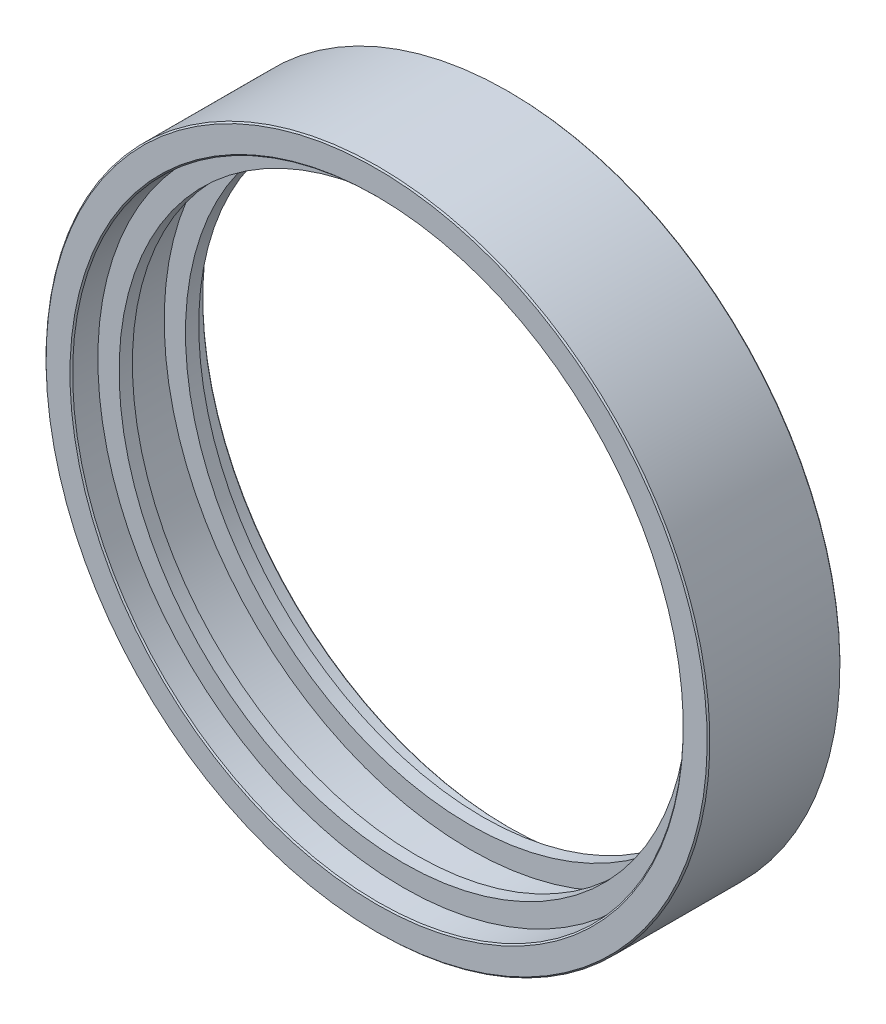
ISO-10303-21;
HEADER;
FILE_DESCRIPTION(('STEP AP214'),'2;1');
FILE_NAME('part.step','',(''),(''),'','','');
FILE_SCHEMA(('AUTOMOTIVE_DESIGN { 1 0 10303 214 1 1 1 1 }'));
ENDSEC;
DATA;
#1=APPLICATION_CONTEXT('core data for automotive mechanical design processes');
#2=APPLICATION_PROTOCOL_DEFINITION('international standard','automotive_design',2000,#1);
#3=PRODUCT_CONTEXT('',#1,'mechanical');
#4=PRODUCT('Part','Part','',(#3));
#5=PRODUCT_RELATED_PRODUCT_CATEGORY('part','',(#4));
#6=PRODUCT_DEFINITION_FORMATION('','',#4);
#7=PRODUCT_DEFINITION_CONTEXT('part definition',#1,'design');
#8=PRODUCT_DEFINITION('design','',#6,#7);
#9=PRODUCT_DEFINITION_SHAPE('','',#8);
#10=(LENGTH_UNIT() NAMED_UNIT(*) SI_UNIT(.MILLI.,.METRE.));
#11=(NAMED_UNIT(*) PLANE_ANGLE_UNIT() SI_UNIT($,.RADIAN.));
#12=(NAMED_UNIT(*) SI_UNIT($,.STERADIAN.) SOLID_ANGLE_UNIT());
#13=UNCERTAINTY_MEASURE_WITH_UNIT(LENGTH_MEASURE(1.E-05),#10,'distance_accuracy_value','');
#14=(GEOMETRIC_REPRESENTATION_CONTEXT(3) GLOBAL_UNCERTAINTY_ASSIGNED_CONTEXT((#13)) GLOBAL_UNIT_ASSIGNED_CONTEXT((#10,
#11,#12)) REPRESENTATION_CONTEXT('',''));
#15=CARTESIAN_POINT('',(0.,0.,0.));
#16=DIRECTION('',(0.,0.,1.));
#17=DIRECTION('',(1.,0.,0.));
#18=AXIS2_PLACEMENT_3D('',#15,#16,#17);
#19=CARTESIAN_POINT('',(0.,11.5,-0.56338028169014));
#20=DIRECTION('',(0.,0.,1.));
#21=DIRECTION('',(0.,-1.,0.));
#22=AXIS2_PLACEMENT_3D('',#19,#20,#21);
#23=PLANE('',#22);
#24=CARTESIAN_POINT('',(0.,0.,-0.563380281690142));
#25=DIRECTION('',(0.,0.,1.));
#26=DIRECTION('',(0.,-1.,0.));
#27=AXIS2_PLACEMENT_3D('',#24,#25,#26);
#28=CIRCLE('',#27,12.45);
#29=CARTESIAN_POINT('',(0.,-12.45,-0.563380281690145));
#30=VERTEX_POINT('',#29);
#31=EDGE_CURVE('E40',#30,#30,#28,.T.);
#32=ORIENTED_EDGE('',*,*,#31,.T.);
#33=EDGE_LOOP('',(#32));
#34=FACE_BOUND('',#33,.T.);
#35=CARTESIAN_POINT('',(0.,0.,-0.563380281690142));
#36=DIRECTION('',(0.,0.,1.));
#37=DIRECTION('',(0.,-1.,0.));
#38=AXIS2_PLACEMENT_3D('',#35,#36,#37);
#39=CIRCLE('',#38,11.55);
#40=CARTESIAN_POINT('',(0.,-11.55,-0.563380281690145));
#41=VERTEX_POINT('',#40);
#42=EDGE_CURVE('E44',#41,#41,#39,.F.);
#43=ORIENTED_EDGE('',*,*,#42,.T.);
#44=EDGE_LOOP('',(#43));
#45=FACE_BOUND('',#44,.T.);
#46=ADVANCED_FACE('F33',(#34,#45),#23,.T.);
#47=CARTESIAN_POINT('',(0.,0.,0.));
#48=DIRECTION('',(0.,0.,-1.));
#49=DIRECTION('',(0.,1.,0.));
#50=AXIS2_PLACEMENT_3D('',#47,#48,#49);
#51=CYLINDRICAL_SURFACE('',#50,12.5);
#52=CARTESIAN_POINT('',(0.,0.,-5.51338028169015));
#53=DIRECTION('',(0.,0.,-1.));
#54=DIRECTION('',(0.,1.,0.));
#55=AXIS2_PLACEMENT_3D('',#52,#53,#54);
#56=CIRCLE('',#55,12.5);
#57=CARTESIAN_POINT('',(0.,12.5,-5.51338028169015));
#58=VERTEX_POINT('',#57);
#59=EDGE_CURVE('E48',#58,#58,#56,.F.);
#60=ORIENTED_EDGE('',*,*,#59,.T.);
#61=EDGE_LOOP('',(#60));
#62=FACE_BOUND('',#61,.T.);
#63=CARTESIAN_POINT('',(0.,0.,-0.613380281690149));
#64=DIRECTION('',(0.,0.,1.));
#65=DIRECTION('',(0.,-1.,0.));
#66=AXIS2_PLACEMENT_3D('',#63,#64,#65);
#67=CIRCLE('',#66,12.5);
#68=CARTESIAN_POINT('',(0.,-12.5,-0.613380281690152));
#69=VERTEX_POINT('',#68);
#70=EDGE_CURVE('E53',#69,#69,#67,.F.);
#71=ORIENTED_EDGE('',*,*,#70,.T.);
#72=EDGE_LOOP('',(#71));
#73=FACE_BOUND('',#72,.T.);
#74=ADVANCED_FACE('F107',(#62,#73),#51,.T.);
#75=CARTESIAN_POINT('',(0.,12.5,-5.56338028169014));
#76=DIRECTION('',(0.,0.,-1.));
#77=DIRECTION('',(0.,1.,0.));
#78=AXIS2_PLACEMENT_3D('',#75,#76,#77);
#79=PLANE('',#78);
#80=CARTESIAN_POINT('',(0.,0.,-5.56338028169014));
#81=DIRECTION('',(0.,0.,-1.));
#82=DIRECTION('',(0.,1.,0.));
#83=AXIS2_PLACEMENT_3D('',#80,#81,#82);
#84=CIRCLE('',#83,11.55);
#85=CARTESIAN_POINT('',(0.,11.55,-5.56338028169014));
#86=VERTEX_POINT('',#85);
#87=EDGE_CURVE('E56',#86,#86,#84,.F.);
#88=ORIENTED_EDGE('',*,*,#87,.T.);
#89=EDGE_LOOP('',(#88));
#90=FACE_BOUND('',#89,.T.);
#91=CARTESIAN_POINT('',(0.,0.,-5.56338028169014));
#92=DIRECTION('',(0.,0.,-1.));
#93=DIRECTION('',(0.,1.,0.));
#94=AXIS2_PLACEMENT_3D('',#91,#92,#93);
#95=CIRCLE('',#94,12.45);
#96=CARTESIAN_POINT('',(0.,12.45,-5.56338028169014));
#97=VERTEX_POINT('',#96);
#98=EDGE_CURVE('E59',#97,#97,#95,.T.);
#99=ORIENTED_EDGE('',*,*,#98,.T.);
#100=EDGE_LOOP('',(#99));
#101=FACE_BOUND('',#100,.T.);
#102=ADVANCED_FACE('F112',(#90,#101),#79,.T.);
#103=CARTESIAN_POINT('',(0.,0.,0.));
#104=DIRECTION('',(0.,0.,-1.));
#105=DIRECTION('',(0.,1.,0.));
#106=AXIS2_PLACEMENT_3D('',#103,#104,#105);
#107=CYLINDRICAL_SURFACE('',#106,11.5);
#108=CARTESIAN_POINT('',(0.,0.,-5.51338028169014));
#109=DIRECTION('',(0.,0.,-1.));
#110=DIRECTION('',(0.,1.,0.));
#111=AXIS2_PLACEMENT_3D('',#108,#109,#110);
#112=CIRCLE('',#111,11.5);
#113=CARTESIAN_POINT('',(0.,11.5,-5.51338028169014));
#114=VERTEX_POINT('',#113);
#115=EDGE_CURVE('E62',#114,#114,#112,.T.);
#116=ORIENTED_EDGE('',*,*,#115,.T.);
#117=EDGE_LOOP('',(#116));
#118=FACE_BOUND('',#117,.T.);
#119=CARTESIAN_POINT('',(0.,0.,-4.56338028169014));
#120=DIRECTION('',(0.,0.,-1.));
#121=DIRECTION('',(0.,1.,0.));
#122=AXIS2_PLACEMENT_3D('',#119,#120,#121);
#123=CIRCLE('',#122,11.5);
#124=CARTESIAN_POINT('',(0.,11.5,-4.56338028169014));
#125=VERTEX_POINT('',#124);
#126=EDGE_CURVE('E65',#125,#125,#123,.T.);
#127=ORIENTED_EDGE('',*,*,#126,.F.);
#128=EDGE_LOOP('',(#127));
#129=FACE_BOUND('',#128,.T.);
#130=ADVANCED_FACE('F166',(#118,#129),#107,.F.);
#131=CARTESIAN_POINT('',(0.,11.5,-4.56338028169014));
#132=DIRECTION('',(0.,0.,-1.));
#133=DIRECTION('',(0.,1.,0.));
#134=AXIS2_PLACEMENT_3D('',#131,#132,#133);
#135=PLANE('',#134);
#136=ORIENTED_EDGE('',*,*,#126,.T.);
#137=EDGE_LOOP('',(#136));
#138=FACE_BOUND('',#137,.T.);
#139=CARTESIAN_POINT('',(0.,0.,-4.56338028169014));
#140=DIRECTION('',(0.,0.,-1.));
#141=DIRECTION('',(0.,1.,0.));
#142=AXIS2_PLACEMENT_3D('',#139,#140,#141);
#143=CIRCLE('',#142,10.7);
#144=CARTESIAN_POINT('',(0.,10.7,-4.56338028169014));
#145=VERTEX_POINT('',#144);
#146=EDGE_CURVE('E68',#145,#145,#143,.T.);
#147=ORIENTED_EDGE('',*,*,#146,.F.);
#148=EDGE_LOOP('',(#147));
#149=FACE_BOUND('',#148,.T.);
#150=ADVANCED_FACE('F171',(#138,#149),#135,.T.);
#151=CARTESIAN_POINT('',(0.,0.,0.));
#152=DIRECTION('',(0.,0.,-1.));
#153=DIRECTION('',(0.,1.,0.));
#154=AXIS2_PLACEMENT_3D('',#151,#152,#153);
#155=CYLINDRICAL_SURFACE('',#154,10.7);
#156=ORIENTED_EDGE('',*,*,#146,.T.);
#157=EDGE_LOOP('',(#156));
#158=FACE_BOUND('',#157,.T.);
#159=CARTESIAN_POINT('',(0.,0.,-4.06338028169014));
#160=DIRECTION('',(0.,0.,-1.));
#161=DIRECTION('',(0.,1.,0.));
#162=AXIS2_PLACEMENT_3D('',#159,#160,#161);
#163=CIRCLE('',#162,10.7);
#164=CARTESIAN_POINT('',(0.,10.7,-4.06338028169014));
#165=VERTEX_POINT('',#164);
#166=EDGE_CURVE('E71',#165,#165,#163,.T.);
#167=ORIENTED_EDGE('',*,*,#166,.F.);
#168=EDGE_LOOP('',(#167));
#169=FACE_BOUND('',#168,.T.);
#170=ADVANCED_FACE('F230',(#158,#169),#155,.F.);
#171=CARTESIAN_POINT('',(0.,10.7,-4.06338028169014));
#172=DIRECTION('',(0.,0.,1.));
#173=DIRECTION('',(0.,-1.,0.));
#174=AXIS2_PLACEMENT_3D('',#171,#172,#173);
#175=PLANE('',#174);
#176=ORIENTED_EDGE('',*,*,#166,.T.);
#177=EDGE_LOOP('',(#176));
#178=FACE_BOUND('',#177,.T.);
#179=CARTESIAN_POINT('',(0.,0.,-4.06338028169014));
#180=DIRECTION('',(0.,0.,-1.));
#181=DIRECTION('',(0.,1.,0.));
#182=AXIS2_PLACEMENT_3D('',#179,#180,#181);
#183=CIRCLE('',#182,11.5);
#184=CARTESIAN_POINT('',(0.,11.5,-4.06338028169014));
#185=VERTEX_POINT('',#184);
#186=EDGE_CURVE('E74',#185,#185,#183,.T.);
#187=ORIENTED_EDGE('',*,*,#186,.F.);
#188=EDGE_LOOP('',(#187));
#189=FACE_BOUND('',#188,.T.);
#190=ADVANCED_FACE('F220',(#178,#189),#175,.T.);
#191=CARTESIAN_POINT('',(0.,0.,0.));
#192=DIRECTION('',(0.,0.,-1.));
#193=DIRECTION('',(0.,1.,0.));
#194=AXIS2_PLACEMENT_3D('',#191,#192,#193);
#195=CYLINDRICAL_SURFACE('',#194,11.5);
#196=ORIENTED_EDGE('',*,*,#186,.T.);
#197=EDGE_LOOP('',(#196));
#198=FACE_BOUND('',#197,.T.);
#199=CARTESIAN_POINT('',(0.,0.,-2.06338028169014));
#200=DIRECTION('',(0.,0.,-1.));
#201=DIRECTION('',(0.,1.,0.));
#202=AXIS2_PLACEMENT_3D('',#199,#200,#201);
#203=CIRCLE('',#202,11.5);
#204=CARTESIAN_POINT('',(0.,11.5,-2.06338028169014));
#205=VERTEX_POINT('',#204);
#206=EDGE_CURVE('E77',#205,#205,#203,.T.);
#207=ORIENTED_EDGE('',*,*,#206,.F.);
#208=EDGE_LOOP('',(#207));
#209=FACE_BOUND('',#208,.T.);
#210=ADVANCED_FACE('F210',(#198,#209),#195,.F.);
#211=CARTESIAN_POINT('',(0.,11.5,-2.06338028169014));
#212=DIRECTION('',(0.,0.,-1.));
#213=DIRECTION('',(0.,1.,0.));
#214=AXIS2_PLACEMENT_3D('',#211,#212,#213);
#215=PLANE('',#214);
#216=ORIENTED_EDGE('',*,*,#206,.T.);
#217=EDGE_LOOP('',(#216));
#218=FACE_BOUND('',#217,.T.);
#219=CARTESIAN_POINT('',(0.,0.,-2.06338028169014));
#220=DIRECTION('',(0.,0.,-1.));
#221=DIRECTION('',(0.,1.,0.));
#222=AXIS2_PLACEMENT_3D('',#219,#220,#221);
#223=CIRCLE('',#222,10.7);
#224=CARTESIAN_POINT('',(0.,10.7,-2.06338028169014));
#225=VERTEX_POINT('',#224);
#226=EDGE_CURVE('E80',#225,#225,#223,.T.);
#227=ORIENTED_EDGE('',*,*,#226,.F.);
#228=EDGE_LOOP('',(#227));
#229=FACE_BOUND('',#228,.T.);
#230=ADVANCED_FACE('F103',(#218,#229),#215,.T.);
#231=CARTESIAN_POINT('',(0.,0.,0.));
#232=DIRECTION('',(0.,0.,-1.));
#233=DIRECTION('',(0.,1.,0.));
#234=AXIS2_PLACEMENT_3D('',#231,#232,#233);
#235=CYLINDRICAL_SURFACE('',#234,10.7);
#236=ORIENTED_EDGE('',*,*,#226,.T.);
#237=EDGE_LOOP('',(#236));
#238=FACE_BOUND('',#237,.T.);
#239=CARTESIAN_POINT('',(0.,0.,-1.56338028169014));
#240=DIRECTION('',(0.,0.,-1.));
#241=DIRECTION('',(0.,1.,0.));
#242=AXIS2_PLACEMENT_3D('',#239,#240,#241);
#243=CIRCLE('',#242,10.7);
#244=CARTESIAN_POINT('',(0.,10.7,-1.56338028169014));
#245=VERTEX_POINT('',#244);
#246=EDGE_CURVE('E83',#245,#245,#243,.T.);
#247=ORIENTED_EDGE('',*,*,#246,.F.);
#248=EDGE_LOOP('',(#247));
#249=FACE_BOUND('',#248,.T.);
#250=ADVANCED_FACE('F94',(#238,#249),#235,.F.);
#251=CARTESIAN_POINT('',(0.,10.7,-1.56338028169014));
#252=DIRECTION('',(0.,0.,1.));
#253=DIRECTION('',(0.,-1.,0.));
#254=AXIS2_PLACEMENT_3D('',#251,#252,#253);
#255=PLANE('',#254);
#256=ORIENTED_EDGE('',*,*,#246,.T.);
#257=EDGE_LOOP('',(#256));
#258=FACE_BOUND('',#257,.T.);
#259=CARTESIAN_POINT('',(0.,0.,-1.56338028169014));
#260=DIRECTION('',(0.,0.,-1.));
#261=DIRECTION('',(0.,1.,0.));
#262=AXIS2_PLACEMENT_3D('',#259,#260,#261);
#263=CIRCLE('',#262,11.5);
#264=CARTESIAN_POINT('',(0.,11.5,-1.56338028169014));
#265=VERTEX_POINT('',#264);
#266=EDGE_CURVE('E86',#265,#265,#263,.T.);
#267=ORIENTED_EDGE('',*,*,#266,.F.);
#268=EDGE_LOOP('',(#267));
#269=FACE_BOUND('',#268,.T.);
#270=ADVANCED_FACE('F92',(#258,#269),#255,.T.);
#271=CARTESIAN_POINT('',(0.,0.,0.));
#272=DIRECTION('',(0.,0.,-1.));
#273=DIRECTION('',(0.,1.,0.));
#274=AXIS2_PLACEMENT_3D('',#271,#272,#273);
#275=CYLINDRICAL_SURFACE('',#274,11.5);
#276=CARTESIAN_POINT('',(0.,0.,-0.61338028169014));
#277=DIRECTION('',(0.,0.,1.));
#278=DIRECTION('',(0.,-1.,0.));
#279=AXIS2_PLACEMENT_3D('',#276,#277,#278);
#280=CIRCLE('',#279,11.5);
#281=CARTESIAN_POINT('',(0.,-11.5,-0.613380281690143));
#282=VERTEX_POINT('',#281);
#283=EDGE_CURVE('E10',#282,#282,#280,.T.);
#284=ORIENTED_EDGE('',*,*,#283,.T.);
#285=EDGE_LOOP('',(#284));
#286=FACE_BOUND('',#285,.T.);
#287=ORIENTED_EDGE('',*,*,#266,.T.);
#288=EDGE_LOOP('',(#287));
#289=FACE_BOUND('',#288,.T.);
#290=ADVANCED_FACE('F90',(#286,#289),#275,.F.);
#291=CARTESIAN_POINT('',(0.,0.,-5.51338028169014));
#292=DIRECTION('',(0.,0.,-1.));
#293=DIRECTION('',(0.,1.,0.));
#294=AXIS2_PLACEMENT_3D('',#291,#292,#293);
#295=CONICAL_SURFACE('',#294,11.5,0.785398163397448);
#296=ORIENTED_EDGE('',*,*,#87,.F.);
#297=EDGE_LOOP('',(#296));
#298=FACE_BOUND('',#297,.T.);
#299=ORIENTED_EDGE('',*,*,#115,.F.);
#300=EDGE_LOOP('',(#299));
#301=FACE_BOUND('',#300,.T.);
#302=ADVANCED_FACE('F101',(#298,#301),#295,.F.);
#303=CARTESIAN_POINT('',(0.,0.,-5.56338028169014));
#304=DIRECTION('',(0.,0.,1.));
#305=DIRECTION('',(0.,-1.,0.));
#306=AXIS2_PLACEMENT_3D('',#303,#304,#305);
#307=CONICAL_SURFACE('',#306,12.45,0.785398163397431);
#308=ORIENTED_EDGE('',*,*,#59,.F.);
#309=EDGE_LOOP('',(#308));
#310=FACE_BOUND('',#309,.T.);
#311=ORIENTED_EDGE('',*,*,#98,.F.);
#312=EDGE_LOOP('',(#311));
#313=FACE_BOUND('',#312,.T.);
#314=ADVANCED_FACE('F120',(#310,#313),#307,.T.);
#315=CARTESIAN_POINT('',(0.,0.,-0.613380281690149));
#316=DIRECTION('',(0.,0.,-1.));
#317=DIRECTION('',(0.,1.,0.));
#318=AXIS2_PLACEMENT_3D('',#315,#316,#317);
#319=CONICAL_SURFACE('',#318,12.5,0.785398163397448);
#320=ORIENTED_EDGE('',*,*,#31,.F.);
#321=EDGE_LOOP('',(#320));
#322=FACE_BOUND('',#321,.T.);
#323=ORIENTED_EDGE('',*,*,#70,.F.);
#324=EDGE_LOOP('',(#323));
#325=FACE_BOUND('',#324,.T.);
#326=ADVANCED_FACE('F123',(#322,#325),#319,.T.);
#327=CARTESIAN_POINT('',(0.,0.,-0.563380281690142));
#328=DIRECTION('',(0.,0.,1.));
#329=DIRECTION('',(0.,-1.,0.));
#330=AXIS2_PLACEMENT_3D('',#327,#328,#329);
#331=CONICAL_SURFACE('',#330,11.55,0.785398163397448);
#332=ORIENTED_EDGE('',*,*,#283,.F.);
#333=EDGE_LOOP('',(#332));
#334=FACE_BOUND('',#333,.T.);
#335=ORIENTED_EDGE('',*,*,#42,.F.);
#336=EDGE_LOOP('',(#335));
#337=FACE_BOUND('',#336,.T.);
#338=ADVANCED_FACE('F35',(#334,#337),#331,.F.);
#339=CLOSED_SHELL('',(#46,#74,#102,#130,#150,#170,#190,#210,#230,#250,#270,#290,#302,#314,#326,#338));
#340=MANIFOLD_SOLID_BREP('B2',#339);
#341=ADVANCED_BREP_SHAPE_REPRESENTATION('',(#18,#340),#14);
#342=SHAPE_DEFINITION_REPRESENTATION(#9,#341);
ENDSEC;
END-ISO-10303-21;
